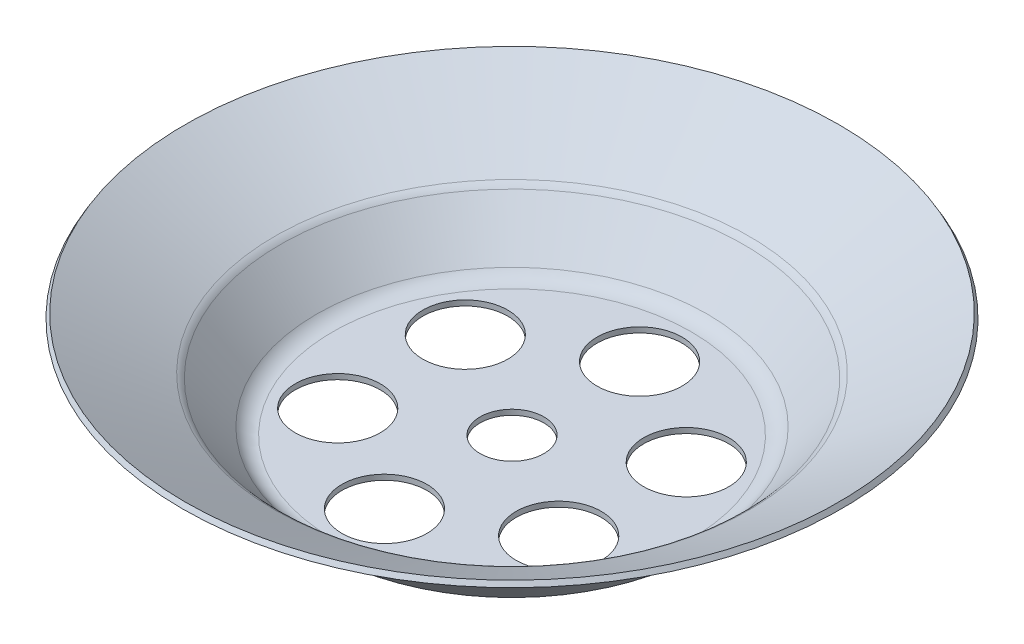
ISO-10303-21;
HEADER;
FILE_DESCRIPTION(('STEP AP214'),'2;1');
FILE_NAME('part.step','',(''),(''),'','','');
FILE_SCHEMA(('AUTOMOTIVE_DESIGN { 1 0 10303 214 1 1 1 1 }'));
ENDSEC;
DATA;
#1=APPLICATION_CONTEXT('core data for automotive mechanical design processes');
#2=APPLICATION_PROTOCOL_DEFINITION('international standard','automotive_design',2000,#1);
#3=PRODUCT_CONTEXT('',#1,'mechanical');
#4=PRODUCT('Part','Part','',(#3));
#5=PRODUCT_RELATED_PRODUCT_CATEGORY('part','',(#4));
#6=PRODUCT_DEFINITION_FORMATION('','',#4);
#7=PRODUCT_DEFINITION_CONTEXT('part definition',#1,'design');
#8=PRODUCT_DEFINITION('design','',#6,#7);
#9=PRODUCT_DEFINITION_SHAPE('','',#8);
#10=(LENGTH_UNIT() NAMED_UNIT(*) SI_UNIT(.MILLI.,.METRE.));
#11=(NAMED_UNIT(*) PLANE_ANGLE_UNIT() SI_UNIT($,.RADIAN.));
#12=(NAMED_UNIT(*) SI_UNIT($,.STERADIAN.) SOLID_ANGLE_UNIT());
#13=UNCERTAINTY_MEASURE_WITH_UNIT(LENGTH_MEASURE(1.E-05),#10,'distance_accuracy_value','');
#14=(GEOMETRIC_REPRESENTATION_CONTEXT(3) GLOBAL_UNCERTAINTY_ASSIGNED_CONTEXT((#13)) GLOBAL_UNIT_ASSIGNED_CONTEXT((#10,
#11,#12)) REPRESENTATION_CONTEXT('',''));
#15=CARTESIAN_POINT('',(0.,0.,0.));
#16=DIRECTION('',(0.,0.,1.));
#17=DIRECTION('',(1.,0.,0.));
#18=AXIS2_PLACEMENT_3D('',#15,#16,#17);
#19=CARTESIAN_POINT('',(0.,2.5,0.));
#20=DIRECTION('',(0.,-1.,0.));
#21=DIRECTION('',(0.,0.,-1.));
#22=AXIS2_PLACEMENT_3D('',#19,#20,#21);
#23=TOROIDAL_SURFACE('',#22,16.8595333075682,2.);
#24=CARTESIAN_POINT('',(0.,1.18903303280818,0.));
#25=DIRECTION('',(0.,1.,0.));
#26=DIRECTION('',(0.,0.,1.));
#27=AXIS2_PLACEMENT_3D('',#24,#25,#26);
#28=CIRCLE('',#27,18.3699523258979);
#29=CARTESIAN_POINT('',(0.,1.18903303280818,18.3699523258979));
#30=VERTEX_POINT('',#29);
#31=EDGE_CURVE('E42',#30,#30,#28,.T.);
#32=ORIENTED_EDGE('',*,*,#31,.T.);
#33=EDGE_LOOP('',(#32));
#34=FACE_BOUND('',#33,.T.);
#35=CARTESIAN_POINT('',(0.,0.5,0.));
#36=DIRECTION('',(0.,-1.,0.));
#37=DIRECTION('',(0.,0.,1.));
#38=AXIS2_PLACEMENT_3D('',#35,#36,#37);
#39=CIRCLE('',#38,16.8595333075682);
#40=CARTESIAN_POINT('',(0.,0.5,16.8595333075682));
#41=VERTEX_POINT('',#40);
#42=CARTESIAN_POINT('',(0.,0.5,-16.8595333075682));
#43=VERTEX_POINT('',#42);
#44=EDGE_CURVE('E39',#41,#43,#39,.T.);
#45=ORIENTED_EDGE('',*,*,#44,.T.);
#46=CARTESIAN_POINT('',(0.,0.5,0.));
#47=DIRECTION('',(0.,-1.,0.));
#48=DIRECTION('',(0.,0.,-1.));
#49=AXIS2_PLACEMENT_3D('',#46,#47,#48);
#50=CIRCLE('',#49,16.8595333075682);
#51=EDGE_CURVE('E36',#43,#41,#50,.T.);
#52=ORIENTED_EDGE('',*,*,#51,.T.);
#53=EDGE_LOOP('',(#45,#52));
#54=FACE_BOUND('',#53,.T.);
#55=ADVANCED_FACE('F18',(#34,#54),#23,.F.);
#56=CARTESIAN_POINT('',(0.,0.5,0.));
#57=DIRECTION('',(0.,-1.,0.));
#58=DIRECTION('',(0.,0.,-1.));
#59=AXIS2_PLACEMENT_3D('',#56,#57,#58);
#60=PLANE('',#59);
#61=CARTESIAN_POINT('',(0.,0.5,0.));
#62=DIRECTION('',(0.,1.,0.));
#63=DIRECTION('',(0.,0.,1.));
#64=AXIS2_PLACEMENT_3D('',#61,#62,#63);
#65=CIRCLE('',#64,3.);
#66=CARTESIAN_POINT('',(0.,0.5,3.));
#67=VERTEX_POINT('',#66);
#68=EDGE_CURVE('E111',#67,#67,#65,.F.);
#69=ORIENTED_EDGE('',*,*,#68,.T.);
#70=EDGE_LOOP('',(#69));
#71=FACE_BOUND('',#70,.T.);
#72=CARTESIAN_POINT('',(0.,0.5,-12.));
#73=DIRECTION('',(0.,1.,0.));
#74=DIRECTION('',(0.,0.,1.));
#75=AXIS2_PLACEMENT_3D('',#72,#73,#74);
#76=CIRCLE('',#75,4.);
#77=CARTESIAN_POINT('',(0.,0.5,-8.));
#78=VERTEX_POINT('',#77);
#79=EDGE_CURVE('E114',#78,#78,#76,.F.);
#80=ORIENTED_EDGE('',*,*,#79,.T.);
#81=EDGE_LOOP('',(#80));
#82=FACE_BOUND('',#81,.T.);
#83=CARTESIAN_POINT('',(-10.3923048454133,0.5,-5.99999999999998));
#84=DIRECTION('',(0.,1.,0.));
#85=DIRECTION('',(0.,0.,1.));
#86=AXIS2_PLACEMENT_3D('',#83,#84,#85);
#87=CIRCLE('',#86,4.);
#88=CARTESIAN_POINT('',(-10.3923048454133,0.5,-1.99999999999998));
#89=VERTEX_POINT('',#88);
#90=EDGE_CURVE('E117',#89,#89,#87,.F.);
#91=ORIENTED_EDGE('',*,*,#90,.T.);
#92=EDGE_LOOP('',(#91));
#93=FACE_BOUND('',#92,.T.);
#94=CARTESIAN_POINT('',(-10.3923048454132,0.5,6.00000000000005));
#95=DIRECTION('',(0.,1.,0.));
#96=DIRECTION('',(0.,0.,1.));
#97=AXIS2_PLACEMENT_3D('',#94,#95,#96);
#98=CIRCLE('',#97,4.);
#99=CARTESIAN_POINT('',(-10.3923048454132,0.5,10.));
#100=VERTEX_POINT('',#99);
#101=EDGE_CURVE('E120',#100,#100,#98,.F.);
#102=ORIENTED_EDGE('',*,*,#101,.T.);
#103=EDGE_LOOP('',(#102));
#104=FACE_BOUND('',#103,.T.);
#105=CARTESIAN_POINT('',(0.,0.5,12.));
#106=DIRECTION('',(0.,1.,0.));
#107=DIRECTION('',(0.,0.,1.));
#108=AXIS2_PLACEMENT_3D('',#105,#106,#107);
#109=CIRCLE('',#108,4.);
#110=CARTESIAN_POINT('',(0.,0.5,16.));
#111=VERTEX_POINT('',#110);
#112=EDGE_CURVE('E123',#111,#111,#109,.F.);
#113=ORIENTED_EDGE('',*,*,#112,.T.);
#114=EDGE_LOOP('',(#113));
#115=FACE_BOUND('',#114,.T.);
#116=CARTESIAN_POINT('',(10.3923048454133,0.5,5.9999999999999));
#117=DIRECTION('',(0.,1.,0.));
#118=DIRECTION('',(0.,0.,1.));
#119=AXIS2_PLACEMENT_3D('',#116,#117,#118);
#120=CIRCLE('',#119,4.);
#121=CARTESIAN_POINT('',(10.3923048454133,0.5,9.9999999999999));
#122=VERTEX_POINT('',#121);
#123=EDGE_CURVE('E126',#122,#122,#120,.F.);
#124=ORIENTED_EDGE('',*,*,#123,.T.);
#125=EDGE_LOOP('',(#124));
#126=FACE_BOUND('',#125,.T.);
#127=CARTESIAN_POINT('',(10.3923048454132,0.5,-6.00000000000012));
#128=DIRECTION('',(0.,1.,0.));
#129=DIRECTION('',(0.,0.,1.));
#130=AXIS2_PLACEMENT_3D('',#127,#128,#129);
#131=CIRCLE('',#130,4.);
#132=CARTESIAN_POINT('',(10.3923048454132,0.5,-2.00000000000012));
#133=VERTEX_POINT('',#132);
#134=EDGE_CURVE('E84',#133,#133,#131,.F.);
#135=ORIENTED_EDGE('',*,*,#134,.T.);
#136=EDGE_LOOP('',(#135));
#137=FACE_BOUND('',#136,.T.);
#138=ORIENTED_EDGE('',*,*,#51,.F.);
#139=ORIENTED_EDGE('',*,*,#44,.F.);
#140=EDGE_LOOP('',(#138,#139));
#141=FACE_BOUND('',#140,.T.);
#142=ADVANCED_FACE('F45',(#71,#82,#93,#104,#115,#126,#137,#141),#60,.F.);
#143=CARTESIAN_POINT('',(0.,5.13772972502714,0.));
#144=DIRECTION('',(0.,1.,0.));
#145=DIRECTION('',(0.,0.,1.));
#146=AXIS2_PLACEMENT_3D('',#143,#144,#145);
#147=CONICAL_SURFACE('',#146,21.7972204310648,0.71482264072439);
#148=ORIENTED_EDGE('',*,*,#31,.F.);
#149=EDGE_LOOP('',(#148));
#150=FACE_BOUND('',#149,.T.);
#151=CARTESIAN_POINT('',(0.,5.13772972502714,0.));
#152=DIRECTION('',(0.,1.,0.));
#153=DIRECTION('',(0.,0.,1.));
#154=AXIS2_PLACEMENT_3D('',#151,#152,#153);
#155=CIRCLE('',#154,21.7972204310648);
#156=CARTESIAN_POINT('',(0.,5.13772972502714,21.7972204310648));
#157=VERTEX_POINT('',#156);
#158=EDGE_CURVE('E48',#157,#157,#155,.F.);
#159=ORIENTED_EDGE('',*,*,#158,.F.);
#160=EDGE_LOOP('',(#159));
#161=FACE_BOUND('',#160,.T.);
#162=ADVANCED_FACE('F61',(#150,#161),#147,.F.);
#163=CARTESIAN_POINT('',(10.3923048454132,-9.5,-6.00000000000012));
#164=DIRECTION('',(0.,1.,0.));
#165=DIRECTION('',(0.,0.,1.));
#166=AXIS2_PLACEMENT_3D('',#163,#164,#165);
#167=CYLINDRICAL_SURFACE('',#166,4.);
#168=CARTESIAN_POINT('',(10.3923048454132,0.,-6.00000000000012));
#169=DIRECTION('',(0.,1.,0.));
#170=DIRECTION('',(0.,0.,1.));
#171=AXIS2_PLACEMENT_3D('',#168,#169,#170);
#172=CIRCLE('',#171,4.);
#173=CARTESIAN_POINT('',(10.3923048454132,0.,-2.00000000000012));
#174=VERTEX_POINT('',#173);
#175=EDGE_CURVE('E108',#174,#174,#172,.F.);
#176=ORIENTED_EDGE('',*,*,#175,.T.);
#177=EDGE_LOOP('',(#176));
#178=FACE_BOUND('',#177,.T.);
#179=ORIENTED_EDGE('',*,*,#134,.F.);
#180=EDGE_LOOP('',(#179));
#181=FACE_BOUND('',#180,.T.);
#182=ADVANCED_FACE('F132',(#178,#181),#167,.F.);
#183=CARTESIAN_POINT('',(10.3923048454133,-9.5,5.9999999999999));
#184=DIRECTION('',(0.,1.,0.));
#185=DIRECTION('',(0.,0.,1.));
#186=AXIS2_PLACEMENT_3D('',#183,#184,#185);
#187=CYLINDRICAL_SURFACE('',#186,4.);
#188=CARTESIAN_POINT('',(10.3923048454133,0.,5.9999999999999));
#189=DIRECTION('',(0.,1.,0.));
#190=DIRECTION('',(0.,0.,1.));
#191=AXIS2_PLACEMENT_3D('',#188,#189,#190);
#192=CIRCLE('',#191,4.);
#193=CARTESIAN_POINT('',(10.3923048454133,0.,9.9999999999999));
#194=VERTEX_POINT('',#193);
#195=EDGE_CURVE('E105',#194,#194,#192,.F.);
#196=ORIENTED_EDGE('',*,*,#195,.T.);
#197=EDGE_LOOP('',(#196));
#198=FACE_BOUND('',#197,.T.);
#199=ORIENTED_EDGE('',*,*,#123,.F.);
#200=EDGE_LOOP('',(#199));
#201=FACE_BOUND('',#200,.T.);
#202=ADVANCED_FACE('F134',(#198,#201),#187,.F.);
#203=CARTESIAN_POINT('',(0.,-9.5,12.));
#204=DIRECTION('',(0.,1.,0.));
#205=DIRECTION('',(0.,0.,1.));
#206=AXIS2_PLACEMENT_3D('',#203,#204,#205);
#207=CYLINDRICAL_SURFACE('',#206,4.);
#208=CARTESIAN_POINT('',(0.,0.,12.));
#209=DIRECTION('',(0.,1.,0.));
#210=DIRECTION('',(0.,0.,1.));
#211=AXIS2_PLACEMENT_3D('',#208,#209,#210);
#212=CIRCLE('',#211,4.);
#213=CARTESIAN_POINT('',(0.,0.,16.));
#214=VERTEX_POINT('',#213);
#215=EDGE_CURVE('E102',#214,#214,#212,.F.);
#216=ORIENTED_EDGE('',*,*,#215,.T.);
#217=EDGE_LOOP('',(#216));
#218=FACE_BOUND('',#217,.T.);
#219=ORIENTED_EDGE('',*,*,#112,.F.);
#220=EDGE_LOOP('',(#219));
#221=FACE_BOUND('',#220,.T.);
#222=ADVANCED_FACE('F141',(#218,#221),#207,.F.);
#223=CARTESIAN_POINT('',(-10.3923048454132,-9.5,6.00000000000005));
#224=DIRECTION('',(0.,1.,0.));
#225=DIRECTION('',(0.,0.,1.));
#226=AXIS2_PLACEMENT_3D('',#223,#224,#225);
#227=CYLINDRICAL_SURFACE('',#226,4.);
#228=CARTESIAN_POINT('',(-10.3923048454132,0.,6.00000000000005));
#229=DIRECTION('',(0.,1.,0.));
#230=DIRECTION('',(0.,0.,1.));
#231=AXIS2_PLACEMENT_3D('',#228,#229,#230);
#232=CIRCLE('',#231,4.);
#233=CARTESIAN_POINT('',(-10.3923048454132,0.,10.));
#234=VERTEX_POINT('',#233);
#235=EDGE_CURVE('E99',#234,#234,#232,.F.);
#236=ORIENTED_EDGE('',*,*,#235,.T.);
#237=EDGE_LOOP('',(#236));
#238=FACE_BOUND('',#237,.T.);
#239=ORIENTED_EDGE('',*,*,#101,.F.);
#240=EDGE_LOOP('',(#239));
#241=FACE_BOUND('',#240,.T.);
#242=ADVANCED_FACE('F205',(#238,#241),#227,.F.);
#243=CARTESIAN_POINT('',(-10.3923048454133,-9.5,-5.99999999999998));
#244=DIRECTION('',(0.,1.,0.));
#245=DIRECTION('',(0.,0.,1.));
#246=AXIS2_PLACEMENT_3D('',#243,#244,#245);
#247=CYLINDRICAL_SURFACE('',#246,4.);
#248=CARTESIAN_POINT('',(-10.3923048454133,0.,-5.99999999999998));
#249=DIRECTION('',(0.,1.,0.));
#250=DIRECTION('',(0.,0.,1.));
#251=AXIS2_PLACEMENT_3D('',#248,#249,#250);
#252=CIRCLE('',#251,4.);
#253=CARTESIAN_POINT('',(-10.3923048454133,0.,-1.99999999999998));
#254=VERTEX_POINT('',#253);
#255=EDGE_CURVE('E96',#254,#254,#252,.F.);
#256=ORIENTED_EDGE('',*,*,#255,.T.);
#257=EDGE_LOOP('',(#256));
#258=FACE_BOUND('',#257,.T.);
#259=ORIENTED_EDGE('',*,*,#90,.F.);
#260=EDGE_LOOP('',(#259));
#261=FACE_BOUND('',#260,.T.);
#262=ADVANCED_FACE('F212',(#258,#261),#247,.F.);
#263=CARTESIAN_POINT('',(0.,-9.5,-12.));
#264=DIRECTION('',(0.,1.,0.));
#265=DIRECTION('',(0.,0.,1.));
#266=AXIS2_PLACEMENT_3D('',#263,#264,#265);
#267=CYLINDRICAL_SURFACE('',#266,4.);
#268=CARTESIAN_POINT('',(0.,0.,-12.));
#269=DIRECTION('',(0.,1.,0.));
#270=DIRECTION('',(0.,0.,1.));
#271=AXIS2_PLACEMENT_3D('',#268,#269,#270);
#272=CIRCLE('',#271,4.);
#273=CARTESIAN_POINT('',(0.,0.,-8.));
#274=VERTEX_POINT('',#273);
#275=EDGE_CURVE('E93',#274,#274,#272,.F.);
#276=ORIENTED_EDGE('',*,*,#275,.T.);
#277=EDGE_LOOP('',(#276));
#278=FACE_BOUND('',#277,.T.);
#279=ORIENTED_EDGE('',*,*,#79,.F.);
#280=EDGE_LOOP('',(#279));
#281=FACE_BOUND('',#280,.T.);
#282=ADVANCED_FACE('F217',(#278,#281),#267,.F.);
#283=CARTESIAN_POINT('',(0.,-9.5,0.));
#284=DIRECTION('',(0.,1.,0.));
#285=DIRECTION('',(0.,0.,1.));
#286=AXIS2_PLACEMENT_3D('',#283,#284,#285);
#287=CYLINDRICAL_SURFACE('',#286,3.);
#288=CARTESIAN_POINT('',(0.,0.,0.));
#289=DIRECTION('',(0.,1.,0.));
#290=DIRECTION('',(0.,0.,1.));
#291=AXIS2_PLACEMENT_3D('',#288,#289,#290);
#292=CIRCLE('',#291,3.);
#293=CARTESIAN_POINT('',(0.,0.,3.));
#294=VERTEX_POINT('',#293);
#295=EDGE_CURVE('E90',#294,#294,#292,.F.);
#296=ORIENTED_EDGE('',*,*,#295,.T.);
#297=EDGE_LOOP('',(#296));
#298=FACE_BOUND('',#297,.T.);
#299=ORIENTED_EDGE('',*,*,#68,.F.);
#300=EDGE_LOOP('',(#299));
#301=FACE_BOUND('',#300,.T.);
#302=ADVANCED_FACE('F172',(#298,#301),#287,.F.);
#303=CARTESIAN_POINT('',(0.,3.82676275783532,0.));
#304=DIRECTION('',(0.,1.,0.));
#305=DIRECTION('',(0.,0.,1.));
#306=AXIS2_PLACEMENT_3D('',#303,#304,#305);
#307=TOROIDAL_SURFACE('',#306,23.3076394493944,2.);
#308=ORIENTED_EDGE('',*,*,#158,.T.);
#309=EDGE_LOOP('',(#308));
#310=FACE_BOUND('',#309,.T.);
#311=CARTESIAN_POINT('',(0.,5.5588135654042,0.));
#312=DIRECTION('',(0.,1.,0.));
#313=DIRECTION('',(0.,0.,1.));
#314=AXIS2_PLACEMENT_3D('',#311,#312,#313);
#315=CIRCLE('',#314,22.3076394493944);
#316=CARTESIAN_POINT('',(0.,5.5588135654042,22.3076394493944));
#317=VERTEX_POINT('',#316);
#318=EDGE_CURVE('E89',#317,#317,#315,.T.);
#319=ORIENTED_EDGE('',*,*,#318,.T.);
#320=EDGE_LOOP('',(#319));
#321=FACE_BOUND('',#320,.T.);
#322=ADVANCED_FACE('F168',(#310,#321),#307,.T.);
#323=CARTESIAN_POINT('',(0.,0.,0.));
#324=DIRECTION('',(0.,1.,0.));
#325=DIRECTION('',(0.,0.,1.));
#326=AXIS2_PLACEMENT_3D('',#323,#324,#325);
#327=PLANE('',#326);
#328=CARTESIAN_POINT('',(0.,0.,0.));
#329=DIRECTION('',(0.,1.,0.));
#330=DIRECTION('',(0.,0.,1.));
#331=AXIS2_PLACEMENT_3D('',#328,#329,#330);
#332=CIRCLE('',#331,18.);
#333=CARTESIAN_POINT('',(0.,0.,18.));
#334=VERTEX_POINT('',#333);
#335=EDGE_CURVE('E85',#334,#334,#332,.T.);
#336=ORIENTED_EDGE('',*,*,#335,.F.);
#337=EDGE_LOOP('',(#336));
#338=FACE_BOUND('',#337,.T.);
#339=ORIENTED_EDGE('',*,*,#295,.F.);
#340=EDGE_LOOP('',(#339));
#341=FACE_BOUND('',#340,.T.);
#342=ORIENTED_EDGE('',*,*,#275,.F.);
#343=EDGE_LOOP('',(#342));
#344=FACE_BOUND('',#343,.T.);
#345=ORIENTED_EDGE('',*,*,#255,.F.);
#346=EDGE_LOOP('',(#345));
#347=FACE_BOUND('',#346,.T.);
#348=ORIENTED_EDGE('',*,*,#235,.F.);
#349=EDGE_LOOP('',(#348));
#350=FACE_BOUND('',#349,.T.);
#351=ORIENTED_EDGE('',*,*,#215,.F.);
#352=EDGE_LOOP('',(#351));
#353=FACE_BOUND('',#352,.T.);
#354=ORIENTED_EDGE('',*,*,#195,.F.);
#355=EDGE_LOOP('',(#354));
#356=FACE_BOUND('',#355,.T.);
#357=ORIENTED_EDGE('',*,*,#175,.F.);
#358=EDGE_LOOP('',(#357));
#359=FACE_BOUND('',#358,.T.);
#360=ADVANCED_FACE('F164',(#338,#341,#344,#347,#350,#353,#356,#359),#327,.F.);
#361=CARTESIAN_POINT('',(0.,10.4330127018922,0.));
#362=DIRECTION('',(0.,1.,0.));
#363=DIRECTION('',(0.,0.,1.));
#364=AXIS2_PLACEMENT_3D('',#361,#362,#363);
#365=CONICAL_SURFACE('',#364,30.75,1.0471975511966);
#366=ORIENTED_EDGE('',*,*,#318,.F.);
#367=EDGE_LOOP('',(#366));
#368=FACE_BOUND('',#367,.T.);
#369=CARTESIAN_POINT('',(0.,10.4330127018922,0.));
#370=DIRECTION('',(0.,-1.,0.));
#371=DIRECTION('',(0.,0.,-1.));
#372=AXIS2_PLACEMENT_3D('',#369,#370,#371);
#373=CIRCLE('',#372,30.75);
#374=CARTESIAN_POINT('',(0.,10.4330127018922,-30.75));
#375=VERTEX_POINT('',#374);
#376=EDGE_CURVE('E88',#375,#375,#373,.T.);
#377=ORIENTED_EDGE('',*,*,#376,.F.);
#378=EDGE_LOOP('',(#377));
#379=FACE_BOUND('',#378,.T.);
#380=ADVANCED_FACE('F160',(#368,#379),#365,.F.);
#381=CARTESIAN_POINT('',(0.,5.,0.));
#382=DIRECTION('',(0.,1.,0.));
#383=DIRECTION('',(0.,0.,1.));
#384=AXIS2_PLACEMENT_3D('',#381,#382,#383);
#385=CONICAL_SURFACE('',#384,22.3397459621556,0.714822640724391);
#386=CARTESIAN_POINT('',(0.,5.,0.));
#387=DIRECTION('',(0.,1.,0.));
#388=DIRECTION('',(0.,0.,1.));
#389=AXIS2_PLACEMENT_3D('',#386,#387,#388);
#390=CIRCLE('',#389,22.3397459621556);
#391=CARTESIAN_POINT('',(0.,5.,22.3397459621556));
#392=VERTEX_POINT('',#391);
#393=EDGE_CURVE('E30',#392,#392,#390,.T.);
#394=ORIENTED_EDGE('',*,*,#393,.F.);
#395=EDGE_LOOP('',(#394));
#396=FACE_BOUND('',#395,.T.);
#397=ORIENTED_EDGE('',*,*,#335,.T.);
#398=EDGE_LOOP('',(#397));
#399=FACE_BOUND('',#398,.T.);
#400=ADVANCED_FACE('F153',(#396,#399),#385,.T.);
#401=CARTESIAN_POINT('',(0.,9.99999999999999,0.));
#402=DIRECTION('',(0.,-1.,0.));
#403=DIRECTION('',(0.,0.,-1.));
#404=AXIS2_PLACEMENT_3D('',#401,#402,#403);
#405=CONICAL_SURFACE('',#404,31.,0.52359877559829);
#406=CARTESIAN_POINT('',(0.,9.99999999999999,0.));
#407=DIRECTION('',(0.,1.,0.));
#408=DIRECTION('',(0.,0.,1.));
#409=AXIS2_PLACEMENT_3D('',#406,#407,#408);
#410=CIRCLE('',#409,31.);
#411=CARTESIAN_POINT('',(0.,9.99999999999999,31.));
#412=VERTEX_POINT('',#411);
#413=EDGE_CURVE('E11',#412,#412,#410,.F.);
#414=ORIENTED_EDGE('',*,*,#413,.F.);
#415=EDGE_LOOP('',(#414));
#416=FACE_BOUND('',#415,.T.);
#417=ORIENTED_EDGE('',*,*,#376,.T.);
#418=EDGE_LOOP('',(#417));
#419=FACE_BOUND('',#418,.T.);
#420=ADVANCED_FACE('F147',(#416,#419),#405,.T.);
#421=CARTESIAN_POINT('',(0.,9.99999999999999,0.));
#422=DIRECTION('',(0.,1.,0.));
#423=DIRECTION('',(0.,0.,1.));
#424=AXIS2_PLACEMENT_3D('',#421,#422,#423);
#425=CONICAL_SURFACE('',#424,31.,1.0471975511966);
#426=ORIENTED_EDGE('',*,*,#413,.T.);
#427=EDGE_LOOP('',(#426));
#428=FACE_BOUND('',#427,.T.);
#429=ORIENTED_EDGE('',*,*,#393,.T.);
#430=EDGE_LOOP('',(#429));
#431=FACE_BOUND('',#430,.T.);
#432=ADVANCED_FACE('F145',(#428,#431),#425,.T.);
#433=CLOSED_SHELL('',(#55,#142,#162,#182,#202,#222,#242,#262,#282,#302,#322,#360,#380,#400,#420,#432));
#434=MANIFOLD_SOLID_BREP('B1',#433);
#435=ADVANCED_BREP_SHAPE_REPRESENTATION('',(#18,#434),#14);
#436=SHAPE_DEFINITION_REPRESENTATION(#9,#435);
ENDSEC;
END-ISO-10303-21;
